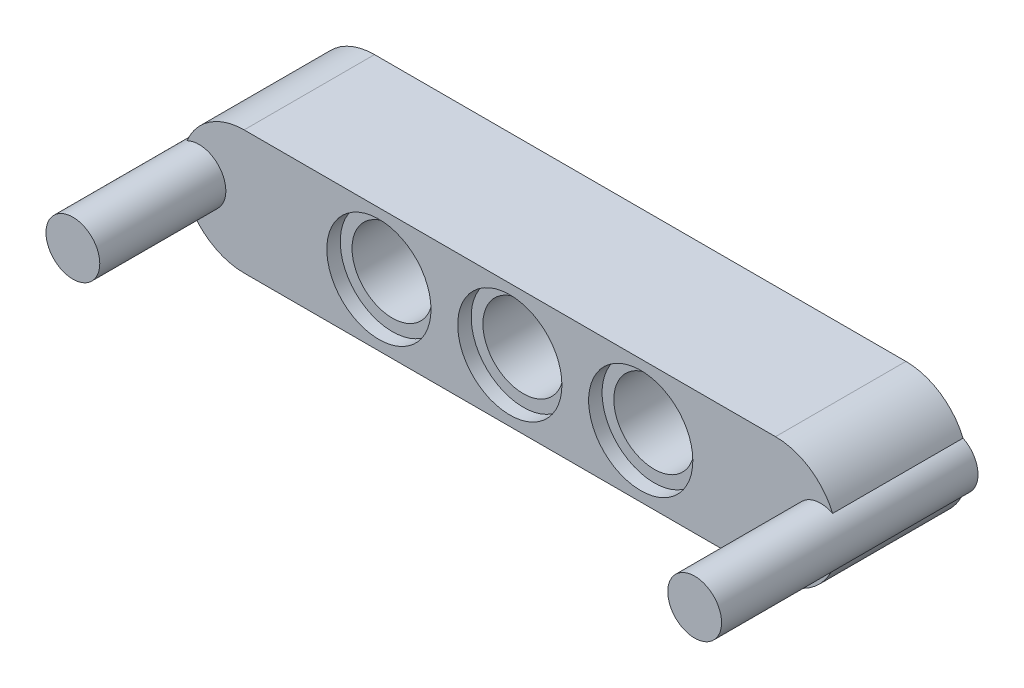
ISO-10303-21;
HEADER;
FILE_DESCRIPTION(('STEP AP214'),'2;1');
FILE_NAME('part.step','',(''),(''),'','','');
FILE_SCHEMA(('AUTOMOTIVE_DESIGN { 1 0 10303 214 1 1 1 1 }'));
ENDSEC;
DATA;
#1=APPLICATION_CONTEXT('core data for automotive mechanical design processes');
#2=APPLICATION_PROTOCOL_DEFINITION('international standard','automotive_design',2000,#1);
#3=PRODUCT_CONTEXT('',#1,'mechanical');
#4=PRODUCT('Part','Part','',(#3));
#5=PRODUCT_RELATED_PRODUCT_CATEGORY('part','',(#4));
#6=PRODUCT_DEFINITION_FORMATION('','',#4);
#7=PRODUCT_DEFINITION_CONTEXT('part definition',#1,'design');
#8=PRODUCT_DEFINITION('design','',#6,#7);
#9=PRODUCT_DEFINITION_SHAPE('','',#8);
#10=(LENGTH_UNIT() NAMED_UNIT(*) SI_UNIT(.MILLI.,.METRE.));
#11=(NAMED_UNIT(*) PLANE_ANGLE_UNIT() SI_UNIT($,.RADIAN.));
#12=(NAMED_UNIT(*) SI_UNIT($,.STERADIAN.) SOLID_ANGLE_UNIT());
#13=UNCERTAINTY_MEASURE_WITH_UNIT(LENGTH_MEASURE(1.E-05),#10,'distance_accuracy_value','');
#14=(GEOMETRIC_REPRESENTATION_CONTEXT(3) GLOBAL_UNCERTAINTY_ASSIGNED_CONTEXT((#13)) GLOBAL_UNIT_ASSIGNED_CONTEXT((#10,
#11,#12)) REPRESENTATION_CONTEXT('',''));
#15=CARTESIAN_POINT('',(0.,0.,0.));
#16=DIRECTION('',(0.,0.,1.));
#17=DIRECTION('',(1.,0.,0.));
#18=AXIS2_PLACEMENT_3D('',#15,#16,#17);
#19=CARTESIAN_POINT('',(35.31,3.69,7.76));
#20=DIRECTION('',(0.,0.,1.));
#21=DIRECTION('',(1.,0.,0.));
#22=AXIS2_PLACEMENT_3D('',#19,#20,#21);
#23=CYLINDRICAL_SURFACE('',#22,3.69);
#24=DIRECTION('',(0.,0.,-1.));
#25=VECTOR('',#24,1.);
#26=CARTESIAN_POINT('',(38.7100371747212,2.25617741316649,4.));
#27=LINE('',#26,#25);
#28=CARTESIAN_POINT('',(38.7100371747212,2.25617741316649,7.76));
#29=VERTEX_POINT('',#28);
#30=CARTESIAN_POINT('',(38.7100371747212,2.25617741316649,0.));
#31=VERTEX_POINT('',#30);
#32=EDGE_CURVE('E165',#29,#31,#27,.T.);
#33=ORIENTED_EDGE('',*,*,#32,.F.);
#34=CARTESIAN_POINT('',(35.31,3.69,7.76));
#35=DIRECTION('',(0.,0.,-1.));
#36=DIRECTION('',(-1.,0.,0.));
#37=AXIS2_PLACEMENT_3D('',#34,#35,#36);
#38=CIRCLE('',#37,3.69);
#39=CARTESIAN_POINT('',(35.31,0.,7.76));
#40=VERTEX_POINT('',#39);
#41=EDGE_CURVE('E42',#40,#29,#38,.F.);
#42=ORIENTED_EDGE('',*,*,#41,.F.);
#43=DIRECTION('',(0.,0.,1.));
#44=VECTOR('',#43,1.);
#45=CARTESIAN_POINT('',(35.31,0.,7.76));
#46=LINE('',#45,#44);
#47=CARTESIAN_POINT('',(35.31,0.,0.));
#48=VERTEX_POINT('',#47);
#49=EDGE_CURVE('E147',#48,#40,#46,.T.);
#50=ORIENTED_EDGE('',*,*,#49,.F.);
#51=CARTESIAN_POINT('',(35.31,3.69,0.));
#52=DIRECTION('',(0.,0.,-1.));
#53=DIRECTION('',(-1.,0.,0.));
#54=AXIS2_PLACEMENT_3D('',#51,#52,#53);
#55=CIRCLE('',#54,3.69);
#56=EDGE_CURVE('E149',#31,#48,#55,.T.);
#57=ORIENTED_EDGE('',*,*,#56,.F.);
#58=EDGE_LOOP('',(#33,#42,#50,#57));
#59=FACE_BOUND('',#58,.T.);
#60=ADVANCED_FACE('F39',(#59),#23,.T.);
#61=CARTESIAN_POINT('',(35.31,3.69,7.76));
#62=DIRECTION('',(0.,0.,1.));
#63=DIRECTION('',(1.,0.,0.));
#64=AXIS2_PLACEMENT_3D('',#61,#62,#63);
#65=CYLINDRICAL_SURFACE('',#64,3.69);
#66=DIRECTION('',(0.,0.,-1.));
#67=VECTOR('',#66,1.);
#68=CARTESIAN_POINT('',(38.7100371747212,5.12382258683351,4.));
#69=LINE('',#68,#67);
#70=CARTESIAN_POINT('',(38.7100371747212,5.12382258683351,0.));
#71=VERTEX_POINT('',#70);
#72=CARTESIAN_POINT('',(38.7100371747212,5.12382258683351,7.76));
#73=VERTEX_POINT('',#72);
#74=EDGE_CURVE('E54',#71,#73,#69,.F.);
#75=ORIENTED_EDGE('',*,*,#74,.F.);
#76=CARTESIAN_POINT('',(35.31,3.69,0.));
#77=DIRECTION('',(0.,0.,-1.));
#78=DIRECTION('',(-1.,0.,0.));
#79=AXIS2_PLACEMENT_3D('',#76,#77,#78);
#80=CIRCLE('',#79,3.69);
#81=CARTESIAN_POINT('',(35.31,7.38,0.));
#82=VERTEX_POINT('',#81);
#83=EDGE_CURVE('E142',#82,#71,#80,.T.);
#84=ORIENTED_EDGE('',*,*,#83,.F.);
#85=DIRECTION('',(0.,0.,1.));
#86=VECTOR('',#85,1.);
#87=CARTESIAN_POINT('',(35.31,7.38,7.76));
#88=LINE('',#87,#86);
#89=CARTESIAN_POINT('',(35.31,7.38,7.76));
#90=VERTEX_POINT('',#89);
#91=EDGE_CURVE('E139',#90,#82,#88,.F.);
#92=ORIENTED_EDGE('',*,*,#91,.F.);
#93=CARTESIAN_POINT('',(35.31,3.69,7.76));
#94=DIRECTION('',(0.,0.,-1.));
#95=DIRECTION('',(-1.,0.,0.));
#96=AXIS2_PLACEMENT_3D('',#93,#94,#95);
#97=CIRCLE('',#96,3.69);
#98=EDGE_CURVE('E145',#73,#90,#97,.F.);
#99=ORIENTED_EDGE('',*,*,#98,.F.);
#100=EDGE_LOOP('',(#75,#84,#92,#99));
#101=FACE_BOUND('',#100,.T.);
#102=ADVANCED_FACE('F266',(#101),#65,.T.);
#103=CARTESIAN_POINT('',(3.69,3.69,7.76));
#104=DIRECTION('',(0.,0.,-1.));
#105=DIRECTION('',(-1.,0.,0.));
#106=AXIS2_PLACEMENT_3D('',#103,#104,#105);
#107=CYLINDRICAL_SURFACE('',#106,3.69);
#108=DIRECTION('',(0.,0.,-1.));
#109=VECTOR('',#108,1.);
#110=CARTESIAN_POINT('',(0.289962825278811,2.25617741316649,4.));
#111=LINE('',#110,#109);
#112=CARTESIAN_POINT('',(0.289962825278811,2.25617741316649,0.));
#113=VERTEX_POINT('',#112);
#114=CARTESIAN_POINT('',(0.289962825278811,2.25617741316649,7.76));
#115=VERTEX_POINT('',#114);
#116=EDGE_CURVE('E61',#113,#115,#111,.F.);
#117=ORIENTED_EDGE('',*,*,#116,.F.);
#118=CARTESIAN_POINT('',(3.69,3.69,0.));
#119=DIRECTION('',(0.,0.,-1.));
#120=DIRECTION('',(-1.,0.,0.));
#121=AXIS2_PLACEMENT_3D('',#118,#119,#120);
#122=CIRCLE('',#121,3.69);
#123=CARTESIAN_POINT('',(3.69,0.,0.));
#124=VERTEX_POINT('',#123);
#125=EDGE_CURVE('E120',#124,#113,#122,.T.);
#126=ORIENTED_EDGE('',*,*,#125,.F.);
#127=DIRECTION('',(0.,0.,-1.));
#128=VECTOR('',#127,1.);
#129=CARTESIAN_POINT('',(3.69,0.,7.76));
#130=LINE('',#129,#128);
#131=CARTESIAN_POINT('',(3.69,0.,7.76));
#132=VERTEX_POINT('',#131);
#133=EDGE_CURVE('E128',#132,#124,#130,.T.);
#134=ORIENTED_EDGE('',*,*,#133,.F.);
#135=CARTESIAN_POINT('',(3.69,3.69,7.76));
#136=DIRECTION('',(0.,0.,-1.));
#137=DIRECTION('',(-1.,0.,0.));
#138=AXIS2_PLACEMENT_3D('',#135,#136,#137);
#139=CIRCLE('',#138,3.69);
#140=EDGE_CURVE('E136',#115,#132,#139,.F.);
#141=ORIENTED_EDGE('',*,*,#140,.F.);
#142=EDGE_LOOP('',(#117,#126,#134,#141));
#143=FACE_BOUND('',#142,.T.);
#144=ADVANCED_FACE('F271',(#143),#107,.T.);
#145=CARTESIAN_POINT('',(3.69,3.69,7.76));
#146=DIRECTION('',(0.,0.,1.));
#147=DIRECTION('',(1.,0.,0.));
#148=AXIS2_PLACEMENT_3D('',#145,#146,#147);
#149=CYLINDRICAL_SURFACE('',#148,3.69);
#150=DIRECTION('',(0.,0.,-1.));
#151=VECTOR('',#150,1.);
#152=CARTESIAN_POINT('',(0.289962825278811,5.12382258683351,4.));
#153=LINE('',#152,#151);
#154=CARTESIAN_POINT('',(0.289962825278811,5.12382258683351,7.76));
#155=VERTEX_POINT('',#154);
#156=CARTESIAN_POINT('',(0.289962825278811,5.12382258683351,0.));
#157=VERTEX_POINT('',#156);
#158=EDGE_CURVE('E102',#155,#157,#153,.T.);
#159=ORIENTED_EDGE('',*,*,#158,.F.);
#160=CARTESIAN_POINT('',(3.69,3.69,7.76));
#161=DIRECTION('',(0.,0.,-1.));
#162=DIRECTION('',(-1.,0.,0.));
#163=AXIS2_PLACEMENT_3D('',#160,#161,#162);
#164=CIRCLE('',#163,3.69);
#165=CARTESIAN_POINT('',(3.69,7.38,7.76));
#166=VERTEX_POINT('',#165);
#167=EDGE_CURVE('E126',#166,#155,#164,.F.);
#168=ORIENTED_EDGE('',*,*,#167,.F.);
#169=DIRECTION('',(0.,0.,1.));
#170=VECTOR('',#169,1.);
#171=CARTESIAN_POINT('',(3.69,7.38,7.76));
#172=LINE('',#171,#170);
#173=CARTESIAN_POINT('',(3.69,7.38,0.));
#174=VERTEX_POINT('',#173);
#175=EDGE_CURVE('E125',#174,#166,#172,.T.);
#176=ORIENTED_EDGE('',*,*,#175,.F.);
#177=CARTESIAN_POINT('',(3.69,3.69,0.));
#178=DIRECTION('',(0.,0.,-1.));
#179=DIRECTION('',(-1.,0.,0.));
#180=AXIS2_PLACEMENT_3D('',#177,#178,#179);
#181=CIRCLE('',#180,3.69);
#182=EDGE_CURVE('E117',#157,#174,#181,.T.);
#183=ORIENTED_EDGE('',*,*,#182,.F.);
#184=EDGE_LOOP('',(#159,#168,#176,#183));
#185=FACE_BOUND('',#184,.T.);
#186=ADVANCED_FACE('F123',(#185),#149,.T.);
#187=CARTESIAN_POINT('',(27.29,3.69,0.));
#188=DIRECTION('',(0.,0.,1.));
#189=DIRECTION('',(1.,0.,0.));
#190=AXIS2_PLACEMENT_3D('',#187,#188,#189);
#191=CYLINDRICAL_SURFACE('',#190,3.1);
#192=CARTESIAN_POINT('',(27.29,3.69,0.));
#193=DIRECTION('',(0.,0.,1.));
#194=DIRECTION('',(1.,0.,0.));
#195=AXIS2_PLACEMENT_3D('',#192,#193,#194);
#196=CIRCLE('',#195,3.1);
#197=CARTESIAN_POINT('',(30.39,3.69,0.));
#198=VERTEX_POINT('',#197);
#199=EDGE_CURVE('E130',#198,#198,#196,.T.);
#200=ORIENTED_EDGE('',*,*,#199,.F.);
#201=EDGE_LOOP('',(#200));
#202=FACE_BOUND('',#201,.T.);
#203=CARTESIAN_POINT('',(27.29,3.69,0.8));
#204=DIRECTION('',(0.,0.,1.));
#205=DIRECTION('',(1.,0.,0.));
#206=AXIS2_PLACEMENT_3D('',#203,#204,#205);
#207=CIRCLE('',#206,3.1);
#208=CARTESIAN_POINT('',(30.39,3.69,0.8));
#209=VERTEX_POINT('',#208);
#210=EDGE_CURVE('E231',#209,#209,#207,.T.);
#211=ORIENTED_EDGE('',*,*,#210,.T.);
#212=EDGE_LOOP('',(#211));
#213=FACE_BOUND('',#212,.T.);
#214=ADVANCED_FACE('F237',(#202,#213),#191,.F.);
#215=CARTESIAN_POINT('',(7.79,0.,0.8));
#216=DIRECTION('',(0.,0.,1.));
#217=DIRECTION('',(1.,0.,0.));
#218=AXIS2_PLACEMENT_3D('',#215,#216,#217);
#219=PLANE('',#218);
#220=ORIENTED_EDGE('',*,*,#210,.F.);
#221=EDGE_LOOP('',(#220));
#222=FACE_BOUND('',#221,.T.);
#223=CARTESIAN_POINT('',(27.29,3.69,0.8));
#224=DIRECTION('',(0.,0.,1.));
#225=DIRECTION('',(1.,0.,0.));
#226=AXIS2_PLACEMENT_3D('',#223,#224,#225);
#227=CIRCLE('',#226,2.4);
#228=CARTESIAN_POINT('',(29.69,3.69,0.8));
#229=VERTEX_POINT('',#228);
#230=EDGE_CURVE('E222',#229,#229,#227,.F.);
#231=ORIENTED_EDGE('',*,*,#230,.F.);
#232=EDGE_LOOP('',(#231));
#233=FACE_BOUND('',#232,.T.);
#234=ADVANCED_FACE('F240',(#222,#233),#219,.F.);
#235=CARTESIAN_POINT('',(7.79,0.,6.95999999999999));
#236=DIRECTION('',(0.,0.,-1.));
#237=DIRECTION('',(-1.,0.,0.));
#238=AXIS2_PLACEMENT_3D('',#235,#236,#237);
#239=PLANE('',#238);
#240=CARTESIAN_POINT('',(27.29,3.69,6.96));
#241=DIRECTION('',(0.,0.,1.));
#242=DIRECTION('',(1.,0.,0.));
#243=AXIS2_PLACEMENT_3D('',#240,#241,#242);
#244=CIRCLE('',#243,3.1);
#245=CARTESIAN_POINT('',(30.39,3.69,6.96));
#246=VERTEX_POINT('',#245);
#247=EDGE_CURVE('E228',#246,#246,#244,.T.);
#248=ORIENTED_EDGE('',*,*,#247,.T.);
#249=EDGE_LOOP('',(#248));
#250=FACE_BOUND('',#249,.T.);
#251=CARTESIAN_POINT('',(27.29,3.69,6.95999999999999));
#252=DIRECTION('',(0.,0.,-1.));
#253=DIRECTION('',(-1.,0.,0.));
#254=AXIS2_PLACEMENT_3D('',#251,#252,#253);
#255=CIRCLE('',#254,2.4);
#256=CARTESIAN_POINT('',(24.89,3.69,6.95999999999999));
#257=VERTEX_POINT('',#256);
#258=EDGE_CURVE('E219',#257,#257,#255,.F.);
#259=ORIENTED_EDGE('',*,*,#258,.F.);
#260=EDGE_LOOP('',(#259));
#261=FACE_BOUND('',#260,.T.);
#262=ADVANCED_FACE('F246',(#250,#261),#239,.F.);
#263=CARTESIAN_POINT('',(27.29,3.69,7.76));
#264=DIRECTION('',(0.,0.,-1.));
#265=DIRECTION('',(-1.,0.,0.));
#266=AXIS2_PLACEMENT_3D('',#263,#264,#265);
#267=CYLINDRICAL_SURFACE('',#266,3.1);
#268=CARTESIAN_POINT('',(27.29,3.69,7.76));
#269=DIRECTION('',(0.,0.,1.));
#270=DIRECTION('',(1.,0.,0.));
#271=AXIS2_PLACEMENT_3D('',#268,#269,#270);
#272=CIRCLE('',#271,3.1);
#273=CARTESIAN_POINT('',(30.39,3.69,7.76));
#274=VERTEX_POINT('',#273);
#275=EDGE_CURVE('E225',#274,#274,#272,.T.);
#276=ORIENTED_EDGE('',*,*,#275,.T.);
#277=EDGE_LOOP('',(#276));
#278=FACE_BOUND('',#277,.T.);
#279=ORIENTED_EDGE('',*,*,#247,.F.);
#280=EDGE_LOOP('',(#279));
#281=FACE_BOUND('',#280,.T.);
#282=ADVANCED_FACE('F253',(#278,#281),#267,.F.);
#283=CARTESIAN_POINT('',(27.29,3.69,0.));
#284=DIRECTION('',(0.,0.,1.));
#285=DIRECTION('',(1.,0.,0.));
#286=AXIS2_PLACEMENT_3D('',#283,#284,#285);
#287=CYLINDRICAL_SURFACE('',#286,2.4);
#288=ORIENTED_EDGE('',*,*,#258,.T.);
#289=EDGE_LOOP('',(#288));
#290=FACE_BOUND('',#289,.T.);
#291=ORIENTED_EDGE('',*,*,#230,.T.);
#292=EDGE_LOOP('',(#291));
#293=FACE_BOUND('',#292,.T.);
#294=ADVANCED_FACE('F250',(#290,#293),#287,.F.);
#295=CARTESIAN_POINT('',(11.71,3.69,7.76));
#296=DIRECTION('',(0.,0.,-1.));
#297=DIRECTION('',(-1.,0.,0.));
#298=AXIS2_PLACEMENT_3D('',#295,#296,#297);
#299=CYLINDRICAL_SURFACE('',#298,3.1);
#300=CARTESIAN_POINT('',(11.71,3.69,7.76));
#301=DIRECTION('',(0.,0.,1.));
#302=DIRECTION('',(1.,0.,0.));
#303=AXIS2_PLACEMENT_3D('',#300,#301,#302);
#304=CIRCLE('',#303,3.1);
#305=CARTESIAN_POINT('',(14.81,3.69,7.76));
#306=VERTEX_POINT('',#305);
#307=EDGE_CURVE('E216',#306,#306,#304,.T.);
#308=ORIENTED_EDGE('',*,*,#307,.T.);
#309=EDGE_LOOP('',(#308));
#310=FACE_BOUND('',#309,.T.);
#311=CARTESIAN_POINT('',(11.71,3.69,6.96));
#312=DIRECTION('',(0.,0.,1.));
#313=DIRECTION('',(1.,0.,0.));
#314=AXIS2_PLACEMENT_3D('',#311,#312,#313);
#315=CIRCLE('',#314,3.1);
#316=CARTESIAN_POINT('',(14.81,3.69,6.96));
#317=VERTEX_POINT('',#316);
#318=EDGE_CURVE('E207',#317,#317,#315,.T.);
#319=ORIENTED_EDGE('',*,*,#318,.F.);
#320=EDGE_LOOP('',(#319));
#321=FACE_BOUND('',#320,.T.);
#322=ADVANCED_FACE('F252',(#310,#321),#299,.F.);
#323=CARTESIAN_POINT('',(-7.79,0.,0.8));
#324=DIRECTION('',(0.,0.,1.));
#325=DIRECTION('',(1.,0.,0.));
#326=AXIS2_PLACEMENT_3D('',#323,#324,#325);
#327=PLANE('',#326);
#328=CARTESIAN_POINT('',(11.71,3.69,0.8));
#329=DIRECTION('',(0.,0.,1.));
#330=DIRECTION('',(1.,0.,0.));
#331=AXIS2_PLACEMENT_3D('',#328,#329,#330);
#332=CIRCLE('',#331,3.1);
#333=CARTESIAN_POINT('',(14.81,3.69,0.8));
#334=VERTEX_POINT('',#333);
#335=EDGE_CURVE('E213',#334,#334,#332,.T.);
#336=ORIENTED_EDGE('',*,*,#335,.F.);
#337=EDGE_LOOP('',(#336));
#338=FACE_BOUND('',#337,.T.);
#339=CARTESIAN_POINT('',(11.71,3.69,0.8));
#340=DIRECTION('',(0.,0.,1.));
#341=DIRECTION('',(1.,0.,0.));
#342=AXIS2_PLACEMENT_3D('',#339,#340,#341);
#343=CIRCLE('',#342,2.4);
#344=CARTESIAN_POINT('',(14.11,3.69,0.8));
#345=VERTEX_POINT('',#344);
#346=EDGE_CURVE('E204',#345,#345,#343,.F.);
#347=ORIENTED_EDGE('',*,*,#346,.F.);
#348=EDGE_LOOP('',(#347));
#349=FACE_BOUND('',#348,.T.);
#350=ADVANCED_FACE('F260',(#338,#349),#327,.F.);
#351=CARTESIAN_POINT('',(11.71,3.69,0.));
#352=DIRECTION('',(0.,0.,1.));
#353=DIRECTION('',(1.,0.,0.));
#354=AXIS2_PLACEMENT_3D('',#351,#352,#353);
#355=CYLINDRICAL_SURFACE('',#354,3.1);
#356=CARTESIAN_POINT('',(11.71,3.69,0.));
#357=DIRECTION('',(0.,0.,1.));
#358=DIRECTION('',(1.,0.,0.));
#359=AXIS2_PLACEMENT_3D('',#356,#357,#358);
#360=CIRCLE('',#359,3.1);
#361=CARTESIAN_POINT('',(14.81,3.69,0.));
#362=VERTEX_POINT('',#361);
#363=EDGE_CURVE('E210',#362,#362,#360,.T.);
#364=ORIENTED_EDGE('',*,*,#363,.F.);
#365=EDGE_LOOP('',(#364));
#366=FACE_BOUND('',#365,.T.);
#367=ORIENTED_EDGE('',*,*,#335,.T.);
#368=EDGE_LOOP('',(#367));
#369=FACE_BOUND('',#368,.T.);
#370=ADVANCED_FACE('F304',(#366,#369),#355,.F.);
#371=CARTESIAN_POINT('',(-7.79,0.,6.95999999999999));
#372=DIRECTION('',(0.,0.,-1.));
#373=DIRECTION('',(-1.,0.,0.));
#374=AXIS2_PLACEMENT_3D('',#371,#372,#373);
#375=PLANE('',#374);
#376=ORIENTED_EDGE('',*,*,#318,.T.);
#377=EDGE_LOOP('',(#376));
#378=FACE_BOUND('',#377,.T.);
#379=CARTESIAN_POINT('',(11.71,3.69,6.95999999999999));
#380=DIRECTION('',(0.,0.,-1.));
#381=DIRECTION('',(-1.,0.,0.));
#382=AXIS2_PLACEMENT_3D('',#379,#380,#381);
#383=CIRCLE('',#382,2.4);
#384=CARTESIAN_POINT('',(9.31,3.69,6.95999999999999));
#385=VERTEX_POINT('',#384);
#386=EDGE_CURVE('E193',#385,#385,#383,.F.);
#387=ORIENTED_EDGE('',*,*,#386,.F.);
#388=EDGE_LOOP('',(#387));
#389=FACE_BOUND('',#388,.T.);
#390=ADVANCED_FACE('F300',(#378,#389),#375,.F.);
#391=CARTESIAN_POINT('',(11.71,3.69,0.));
#392=DIRECTION('',(0.,0.,1.));
#393=DIRECTION('',(1.,0.,0.));
#394=AXIS2_PLACEMENT_3D('',#391,#392,#393);
#395=CYLINDRICAL_SURFACE('',#394,2.4);
#396=ORIENTED_EDGE('',*,*,#386,.T.);
#397=EDGE_LOOP('',(#396));
#398=FACE_BOUND('',#397,.T.);
#399=ORIENTED_EDGE('',*,*,#346,.T.);
#400=EDGE_LOOP('',(#399));
#401=FACE_BOUND('',#400,.T.);
#402=ADVANCED_FACE('F294',(#398,#401),#395,.F.);
#403=CARTESIAN_POINT('',(0.,0.,7.76));
#404=DIRECTION('',(0.,1.,0.));
#405=DIRECTION('',(0.,0.,1.));
#406=AXIS2_PLACEMENT_3D('',#403,#404,#405);
#407=PLANE('',#406);
#408=DIRECTION('',(1.,0.,0.));
#409=VECTOR('',#408,1.);
#410=CARTESIAN_POINT('',(0.,0.,0.));
#411=LINE('',#410,#409);
#412=EDGE_CURVE('E194',#124,#48,#411,.T.);
#413=ORIENTED_EDGE('',*,*,#412,.T.);
#414=ORIENTED_EDGE('',*,*,#49,.T.);
#415=DIRECTION('',(1.,0.,0.));
#416=VECTOR('',#415,1.);
#417=CARTESIAN_POINT('',(0.,0.,7.76));
#418=LINE('',#417,#416);
#419=EDGE_CURVE('E161',#132,#40,#418,.T.);
#420=ORIENTED_EDGE('',*,*,#419,.F.);
#421=ORIENTED_EDGE('',*,*,#133,.T.);
#422=EDGE_LOOP('',(#413,#414,#420,#421));
#423=FACE_BOUND('',#422,.T.);
#424=ADVANCED_FACE('F274',(#423),#407,.F.);
#425=CARTESIAN_POINT('',(0.,7.38,7.76));
#426=DIRECTION('',(0.,-1.,0.));
#427=DIRECTION('',(0.,0.,-1.));
#428=AXIS2_PLACEMENT_3D('',#425,#426,#427);
#429=PLANE('',#428);
#430=DIRECTION('',(-1.,0.,0.));
#431=VECTOR('',#430,1.);
#432=CARTESIAN_POINT('',(0.,7.38,7.76));
#433=LINE('',#432,#431);
#434=EDGE_CURVE('E190',#90,#166,#433,.T.);
#435=ORIENTED_EDGE('',*,*,#434,.F.);
#436=ORIENTED_EDGE('',*,*,#91,.T.);
#437=DIRECTION('',(-1.,0.,0.));
#438=VECTOR('',#437,1.);
#439=CARTESIAN_POINT('',(0.,7.38,0.));
#440=LINE('',#439,#438);
#441=EDGE_CURVE('E191',#82,#174,#440,.T.);
#442=ORIENTED_EDGE('',*,*,#441,.T.);
#443=ORIENTED_EDGE('',*,*,#175,.T.);
#444=EDGE_LOOP('',(#435,#436,#442,#443));
#445=FACE_BOUND('',#444,.T.);
#446=ADVANCED_FACE('F285',(#445),#429,.F.);
#447=CARTESIAN_POINT('',(0.,0.,7.76));
#448=DIRECTION('',(0.,0.,-1.));
#449=DIRECTION('',(-1.,0.,0.));
#450=AXIS2_PLACEMENT_3D('',#447,#448,#449);
#451=PLANE('',#450);
#452=CARTESIAN_POINT('',(38.,3.69,7.76));
#453=DIRECTION('',(0.,0.,1.));
#454=DIRECTION('',(1.,0.,0.));
#455=AXIS2_PLACEMENT_3D('',#452,#453,#454);
#456=CIRCLE('',#455,1.6);
#457=EDGE_CURVE('E158',#73,#29,#456,.T.);
#458=ORIENTED_EDGE('',*,*,#457,.F.);
#459=ORIENTED_EDGE('',*,*,#98,.T.);
#460=ORIENTED_EDGE('',*,*,#434,.T.);
#461=ORIENTED_EDGE('',*,*,#167,.T.);
#462=CARTESIAN_POINT('',(1.,3.69,7.76));
#463=DIRECTION('',(0.,0.,1.));
#464=DIRECTION('',(1.,0.,0.));
#465=AXIS2_PLACEMENT_3D('',#462,#463,#464);
#466=CIRCLE('',#465,1.6);
#467=EDGE_CURVE('E12',#115,#155,#466,.T.);
#468=ORIENTED_EDGE('',*,*,#467,.F.);
#469=ORIENTED_EDGE('',*,*,#140,.T.);
#470=ORIENTED_EDGE('',*,*,#419,.T.);
#471=ORIENTED_EDGE('',*,*,#41,.T.);
#472=EDGE_LOOP('',(#458,#459,#460,#461,#468,#469,#470,#471));
#473=FACE_BOUND('',#472,.T.);
#474=ORIENTED_EDGE('',*,*,#275,.F.);
#475=EDGE_LOOP('',(#474));
#476=FACE_BOUND('',#475,.T.);
#477=ORIENTED_EDGE('',*,*,#307,.F.);
#478=EDGE_LOOP('',(#477));
#479=FACE_BOUND('',#478,.T.);
#480=CARTESIAN_POINT('',(19.5,3.69,7.76));
#481=DIRECTION('',(0.,0.,1.));
#482=DIRECTION('',(1.,0.,0.));
#483=AXIS2_PLACEMENT_3D('',#480,#481,#482);
#484=CIRCLE('',#483,3.1);
#485=CARTESIAN_POINT('',(22.6,3.69,7.76));
#486=VERTEX_POINT('',#485);
#487=EDGE_CURVE('E174',#486,#486,#484,.T.);
#488=ORIENTED_EDGE('',*,*,#487,.F.);
#489=EDGE_LOOP('',(#488));
#490=FACE_BOUND('',#489,.T.);
#491=ADVANCED_FACE('F156',(#473,#476,#479,#490),#451,.F.);
#492=CARTESIAN_POINT('',(0.,0.,0.));
#493=DIRECTION('',(0.,0.,-1.));
#494=DIRECTION('',(-1.,0.,0.));
#495=AXIS2_PLACEMENT_3D('',#492,#493,#494);
#496=PLANE('',#495);
#497=ORIENTED_EDGE('',*,*,#125,.T.);
#498=CARTESIAN_POINT('',(1.,3.69,0.));
#499=DIRECTION('',(0.,0.,-1.));
#500=DIRECTION('',(-1.,0.,0.));
#501=AXIS2_PLACEMENT_3D('',#498,#499,#500);
#502=CIRCLE('',#501,1.6);
#503=EDGE_CURVE('E106',#113,#157,#502,.T.);
#504=ORIENTED_EDGE('',*,*,#503,.T.);
#505=ORIENTED_EDGE('',*,*,#182,.T.);
#506=ORIENTED_EDGE('',*,*,#441,.F.);
#507=ORIENTED_EDGE('',*,*,#83,.T.);
#508=CARTESIAN_POINT('',(38.,3.69,0.));
#509=DIRECTION('',(0.,0.,-1.));
#510=DIRECTION('',(-1.,0.,0.));
#511=AXIS2_PLACEMENT_3D('',#508,#509,#510);
#512=CIRCLE('',#511,1.6);
#513=EDGE_CURVE('E278',#71,#31,#512,.T.);
#514=ORIENTED_EDGE('',*,*,#513,.T.);
#515=ORIENTED_EDGE('',*,*,#56,.T.);
#516=ORIENTED_EDGE('',*,*,#412,.F.);
#517=EDGE_LOOP('',(#497,#504,#505,#506,#507,#514,#515,#516));
#518=FACE_BOUND('',#517,.T.);
#519=ORIENTED_EDGE('',*,*,#199,.T.);
#520=EDGE_LOOP('',(#519));
#521=FACE_BOUND('',#520,.T.);
#522=ORIENTED_EDGE('',*,*,#363,.T.);
#523=EDGE_LOOP('',(#522));
#524=FACE_BOUND('',#523,.T.);
#525=CARTESIAN_POINT('',(19.5,3.69,0.));
#526=DIRECTION('',(0.,0.,1.));
#527=DIRECTION('',(1.,0.,0.));
#528=AXIS2_PLACEMENT_3D('',#525,#526,#527);
#529=CIRCLE('',#528,3.1);
#530=CARTESIAN_POINT('',(22.6,3.69,0.));
#531=VERTEX_POINT('',#530);
#532=EDGE_CURVE('E182',#531,#531,#529,.T.);
#533=ORIENTED_EDGE('',*,*,#532,.T.);
#534=EDGE_LOOP('',(#533));
#535=FACE_BOUND('',#534,.T.);
#536=ADVANCED_FACE('F114',(#518,#521,#524,#535),#496,.T.);
#537=CARTESIAN_POINT('',(19.5,3.69,0.));
#538=DIRECTION('',(0.,0.,1.));
#539=DIRECTION('',(1.,0.,0.));
#540=AXIS2_PLACEMENT_3D('',#537,#538,#539);
#541=CYLINDRICAL_SURFACE('',#540,2.4);
#542=CARTESIAN_POINT('',(19.5,3.69,6.95999999999999));
#543=DIRECTION('',(0.,0.,-1.));
#544=DIRECTION('',(-1.,0.,0.));
#545=AXIS2_PLACEMENT_3D('',#542,#543,#544);
#546=CIRCLE('',#545,2.4);
#547=CARTESIAN_POINT('',(17.1,3.69,6.95999999999999));
#548=VERTEX_POINT('',#547);
#549=EDGE_CURVE('E181',#548,#548,#546,.F.);
#550=ORIENTED_EDGE('',*,*,#549,.T.);
#551=EDGE_LOOP('',(#550));
#552=FACE_BOUND('',#551,.T.);
#553=CARTESIAN_POINT('',(19.5,3.69,0.8));
#554=DIRECTION('',(0.,0.,1.));
#555=DIRECTION('',(1.,0.,0.));
#556=AXIS2_PLACEMENT_3D('',#553,#554,#555);
#557=CIRCLE('',#556,2.4);
#558=CARTESIAN_POINT('',(21.9,3.69,0.8));
#559=VERTEX_POINT('',#558);
#560=EDGE_CURVE('E188',#559,#559,#557,.F.);
#561=ORIENTED_EDGE('',*,*,#560,.T.);
#562=EDGE_LOOP('',(#561));
#563=FACE_BOUND('',#562,.T.);
#564=ADVANCED_FACE('F387',(#552,#563),#541,.F.);
#565=CARTESIAN_POINT('',(0.,0.,0.8));
#566=DIRECTION('',(0.,0.,1.));
#567=DIRECTION('',(1.,0.,0.));
#568=AXIS2_PLACEMENT_3D('',#565,#566,#567);
#569=PLANE('',#568);
#570=CARTESIAN_POINT('',(19.5,3.69,0.8));
#571=DIRECTION('',(0.,0.,1.));
#572=DIRECTION('',(1.,0.,0.));
#573=AXIS2_PLACEMENT_3D('',#570,#571,#572);
#574=CIRCLE('',#573,3.1);
#575=CARTESIAN_POINT('',(22.6,3.69,0.8));
#576=VERTEX_POINT('',#575);
#577=EDGE_CURVE('E185',#576,#576,#574,.T.);
#578=ORIENTED_EDGE('',*,*,#577,.F.);
#579=EDGE_LOOP('',(#578));
#580=FACE_BOUND('',#579,.T.);
#581=ORIENTED_EDGE('',*,*,#560,.F.);
#582=EDGE_LOOP('',(#581));
#583=FACE_BOUND('',#582,.T.);
#584=ADVANCED_FACE('F443',(#580,#583),#569,.F.);
#585=CARTESIAN_POINT('',(19.5,3.69,0.));
#586=DIRECTION('',(0.,0.,1.));
#587=DIRECTION('',(1.,0.,0.));
#588=AXIS2_PLACEMENT_3D('',#585,#586,#587);
#589=CYLINDRICAL_SURFACE('',#588,3.1);
#590=ORIENTED_EDGE('',*,*,#532,.F.);
#591=EDGE_LOOP('',(#590));
#592=FACE_BOUND('',#591,.T.);
#593=ORIENTED_EDGE('',*,*,#577,.T.);
#594=EDGE_LOOP('',(#593));
#595=FACE_BOUND('',#594,.T.);
#596=ADVANCED_FACE('F454',(#592,#595),#589,.F.);
#597=CARTESIAN_POINT('',(0.,0.,6.95999999999999));
#598=DIRECTION('',(0.,0.,-1.));
#599=DIRECTION('',(-1.,0.,0.));
#600=AXIS2_PLACEMENT_3D('',#597,#598,#599);
#601=PLANE('',#600);
#602=CARTESIAN_POINT('',(19.5,3.69,6.96));
#603=DIRECTION('',(0.,0.,1.));
#604=DIRECTION('',(1.,0.,0.));
#605=AXIS2_PLACEMENT_3D('',#602,#603,#604);
#606=CIRCLE('',#605,3.1);
#607=CARTESIAN_POINT('',(22.6,3.69,6.96));
#608=VERTEX_POINT('',#607);
#609=EDGE_CURVE('E178',#608,#608,#606,.T.);
#610=ORIENTED_EDGE('',*,*,#609,.T.);
#611=EDGE_LOOP('',(#610));
#612=FACE_BOUND('',#611,.T.);
#613=ORIENTED_EDGE('',*,*,#549,.F.);
#614=EDGE_LOOP('',(#613));
#615=FACE_BOUND('',#614,.T.);
#616=ADVANCED_FACE('F462',(#612,#615),#601,.F.);
#617=CARTESIAN_POINT('',(19.5,3.69,7.76));
#618=DIRECTION('',(0.,0.,-1.));
#619=DIRECTION('',(-1.,0.,0.));
#620=AXIS2_PLACEMENT_3D('',#617,#618,#619);
#621=CYLINDRICAL_SURFACE('',#620,3.1);
#622=ORIENTED_EDGE('',*,*,#487,.T.);
#623=EDGE_LOOP('',(#622));
#624=FACE_BOUND('',#623,.T.);
#625=ORIENTED_EDGE('',*,*,#609,.F.);
#626=EDGE_LOOP('',(#625));
#627=FACE_BOUND('',#626,.T.);
#628=ADVANCED_FACE('F378',(#624,#627),#621,.F.);
#629=CARTESIAN_POINT('',(1.,3.69,15.26));
#630=DIRECTION('',(0.,0.,-1.));
#631=DIRECTION('',(-1.,0.,0.));
#632=AXIS2_PLACEMENT_3D('',#629,#630,#631);
#633=CYLINDRICAL_SURFACE('',#632,1.6);
#634=ORIENTED_EDGE('',*,*,#467,.T.);
#635=ORIENTED_EDGE('',*,*,#158,.T.);
#636=ORIENTED_EDGE('',*,*,#503,.F.);
#637=ORIENTED_EDGE('',*,*,#116,.T.);
#638=EDGE_LOOP('',(#634,#635,#636,#637));
#639=FACE_BOUND('',#638,.T.);
#640=CARTESIAN_POINT('',(1.,3.69,15.26));
#641=DIRECTION('',(0.,0.,1.));
#642=DIRECTION('',(1.,0.,0.));
#643=AXIS2_PLACEMENT_3D('',#640,#641,#642);
#644=CIRCLE('',#643,1.6);
#645=CARTESIAN_POINT('',(2.6,3.69,15.26));
#646=VERTEX_POINT('',#645);
#647=EDGE_CURVE('E169',#646,#646,#644,.T.);
#648=ORIENTED_EDGE('',*,*,#647,.F.);
#649=EDGE_LOOP('',(#648));
#650=FACE_BOUND('',#649,.T.);
#651=ADVANCED_FACE('F104',(#639,#650),#633,.T.);
#652=CARTESIAN_POINT('',(1.,3.69,15.26));
#653=DIRECTION('',(0.,0.,1.));
#654=DIRECTION('',(1.,0.,0.));
#655=AXIS2_PLACEMENT_3D('',#652,#653,#654);
#656=PLANE('',#655);
#657=ORIENTED_EDGE('',*,*,#647,.T.);
#658=EDGE_LOOP('',(#657));
#659=FACE_BOUND('',#658,.T.);
#660=ADVANCED_FACE('F344',(#659),#656,.T.);
#661=CARTESIAN_POINT('',(38.,3.69,15.26));
#662=DIRECTION('',(0.,0.,-1.));
#663=DIRECTION('',(-1.,0.,0.));
#664=AXIS2_PLACEMENT_3D('',#661,#662,#663);
#665=CYLINDRICAL_SURFACE('',#664,1.6);
#666=ORIENTED_EDGE('',*,*,#457,.T.);
#667=ORIENTED_EDGE('',*,*,#32,.T.);
#668=ORIENTED_EDGE('',*,*,#513,.F.);
#669=ORIENTED_EDGE('',*,*,#74,.T.);
#670=EDGE_LOOP('',(#666,#667,#668,#669));
#671=FACE_BOUND('',#670,.T.);
#672=CARTESIAN_POINT('',(38.,3.69,15.26));
#673=DIRECTION('',(0.,0.,1.));
#674=DIRECTION('',(1.,0.,0.));
#675=AXIS2_PLACEMENT_3D('',#672,#673,#674);
#676=CIRCLE('',#675,1.6);
#677=CARTESIAN_POINT('',(39.6,3.69,15.26));
#678=VERTEX_POINT('',#677);
#679=EDGE_CURVE('E166',#678,#678,#676,.T.);
#680=ORIENTED_EDGE('',*,*,#679,.F.);
#681=EDGE_LOOP('',(#680));
#682=FACE_BOUND('',#681,.T.);
#683=ADVANCED_FACE('F163',(#671,#682),#665,.T.);
#684=CARTESIAN_POINT('',(38.,3.69,15.26));
#685=DIRECTION('',(0.,0.,1.));
#686=DIRECTION('',(1.,0.,0.));
#687=AXIS2_PLACEMENT_3D('',#684,#685,#686);
#688=PLANE('',#687);
#689=ORIENTED_EDGE('',*,*,#679,.T.);
#690=EDGE_LOOP('',(#689));
#691=FACE_BOUND('',#690,.T.);
#692=ADVANCED_FACE('F357',(#691),#688,.T.);
#693=CLOSED_SHELL('',(#60,#102,#144,#186,#214,#234,#262,#282,#294,#322,#350,#370,#390,#402,#424,
#446,#491,#536,#564,#584,#596,#616,#628,#651,#660,#683,#692));
#694=MANIFOLD_SOLID_BREP('B2',#693);
#695=ADVANCED_BREP_SHAPE_REPRESENTATION('',(#18,#694),#14);
#696=SHAPE_DEFINITION_REPRESENTATION(#9,#695);
ENDSEC;
END-ISO-10303-21;
